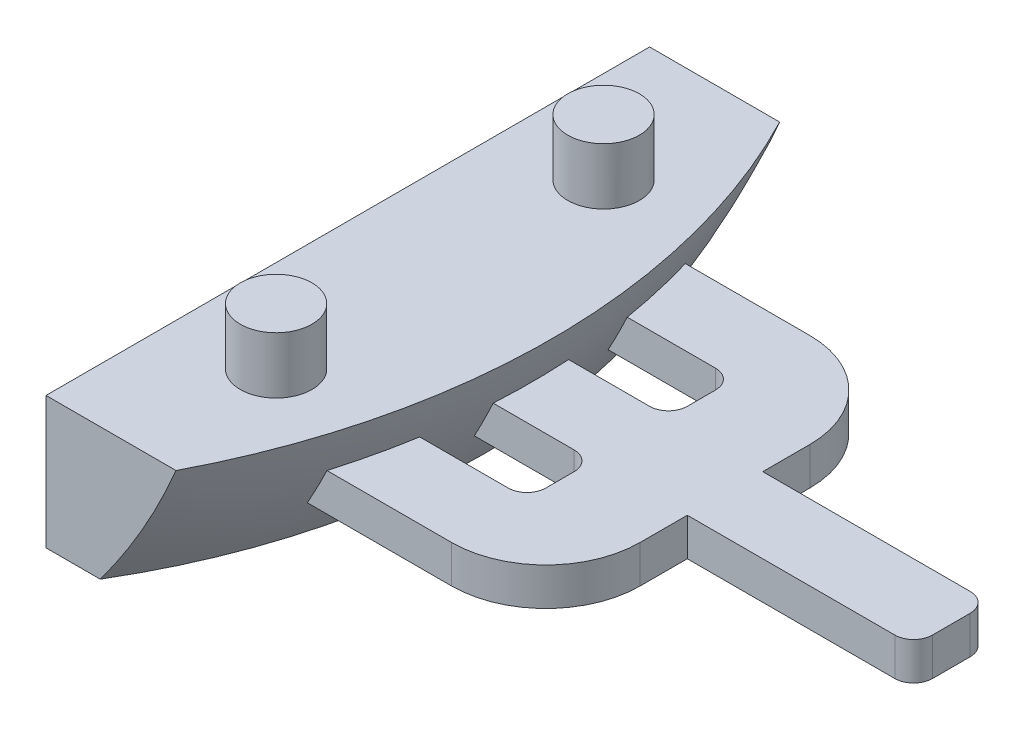
ISO-10303-21;
HEADER;
FILE_DESCRIPTION(('STEP AP214'),'2;1');
FILE_NAME('part.step','',(''),(''),'','','');
FILE_SCHEMA(('AUTOMOTIVE_DESIGN { 1 0 10303 214 1 1 1 1 }'));
ENDSEC;
DATA;
#1=APPLICATION_CONTEXT('core data for automotive mechanical design processes');
#2=APPLICATION_PROTOCOL_DEFINITION('international standard','automotive_design',2000,#1);
#3=PRODUCT_CONTEXT('',#1,'mechanical');
#4=PRODUCT('Part','Part','',(#3));
#5=PRODUCT_RELATED_PRODUCT_CATEGORY('part','',(#4));
#6=PRODUCT_DEFINITION_FORMATION('','',#4);
#7=PRODUCT_DEFINITION_CONTEXT('part definition',#1,'design');
#8=PRODUCT_DEFINITION('design','',#6,#7);
#9=PRODUCT_DEFINITION_SHAPE('','',#8);
#10=(LENGTH_UNIT() NAMED_UNIT(*) SI_UNIT(.MILLI.,.METRE.));
#11=(NAMED_UNIT(*) PLANE_ANGLE_UNIT() SI_UNIT($,.RADIAN.));
#12=(NAMED_UNIT(*) SI_UNIT($,.STERADIAN.) SOLID_ANGLE_UNIT());
#13=UNCERTAINTY_MEASURE_WITH_UNIT(LENGTH_MEASURE(1.E-05),#10,'distance_accuracy_value','');
#14=(GEOMETRIC_REPRESENTATION_CONTEXT(3) GLOBAL_UNCERTAINTY_ASSIGNED_CONTEXT((#13)) GLOBAL_UNIT_ASSIGNED_CONTEXT((#10,
#11,#12)) REPRESENTATION_CONTEXT('',''));
#15=CARTESIAN_POINT('',(0.,0.,0.));
#16=DIRECTION('',(0.,0.,1.));
#17=DIRECTION('',(1.,0.,0.));
#18=AXIS2_PLACEMENT_3D('',#15,#16,#17);
#19=CARTESIAN_POINT('',(43.83,0.,0.));
#20=DIRECTION('',(-1.,0.,0.));
#21=DIRECTION('',(0.,0.,1.));
#22=AXIS2_PLACEMENT_3D('',#19,#20,#21);
#23=PLANE('',#22);
#24=DIRECTION('',(0.,0.,-1.));
#25=VECTOR('',#24,1.);
#26=CARTESIAN_POINT('',(43.83,-17.5,9.5));
#27=LINE('',#26,#25);
#28=CARTESIAN_POINT('',(43.83,-17.5,-1.99999999999999));
#29=VERTEX_POINT('',#28);
#30=CARTESIAN_POINT('',(43.83,-17.5,-4.5));
#31=VERTEX_POINT('',#30);
#32=EDGE_CURVE('E240',#29,#31,#27,.T.);
#33=ORIENTED_EDGE('',*,*,#32,.T.);
#34=DIRECTION('',(0.,1.,0.));
#35=VECTOR('',#34,1.);
#36=CARTESIAN_POINT('',(43.83,-15.5,-4.49999999999999));
#37=LINE('',#36,#35);
#38=CARTESIAN_POINT('',(43.83,-15.5,-4.5));
#39=VERTEX_POINT('',#38);
#40=EDGE_CURVE('E248',#31,#39,#37,.T.);
#41=ORIENTED_EDGE('',*,*,#40,.T.);
#42=DIRECTION('',(0.,0.,1.));
#43=VECTOR('',#42,1.);
#44=CARTESIAN_POINT('',(43.83,-15.5,9.5));
#45=LINE('',#44,#43);
#46=CARTESIAN_POINT('',(43.83,-15.5,-1.99999999999999));
#47=VERTEX_POINT('',#46);
#48=EDGE_CURVE('E343',#39,#47,#45,.T.);
#49=ORIENTED_EDGE('',*,*,#48,.T.);
#50=DIRECTION('',(0.,1.,0.));
#51=VECTOR('',#50,1.);
#52=CARTESIAN_POINT('',(43.83,0.,-1.99999999999999));
#53=LINE('',#52,#51);
#54=EDGE_CURVE('E244',#29,#47,#53,.T.);
#55=ORIENTED_EDGE('',*,*,#54,.F.);
#56=EDGE_LOOP('',(#33,#41,#49,#55));
#57=FACE_BOUND('',#56,.T.);
#58=ADVANCED_FACE('F35',(#57),#23,.F.);
#59=CARTESIAN_POINT('',(0.,-13.,0.));
#60=DIRECTION('',(0.,-1.,0.));
#61=DIRECTION('',(0.,0.,-1.));
#62=AXIS2_PLACEMENT_3D('',#59,#60,#61);
#63=PLANE('',#62);
#64=CARTESIAN_POINT('',(28.71,-13.,8.68));
#65=DIRECTION('',(0.,-1.,0.));
#66=DIRECTION('',(0.,0.,-1.));
#67=AXIS2_PLACEMENT_3D('',#64,#65,#66);
#68=CIRCLE('',#67,1.9);
#69=CARTESIAN_POINT('',(28.71,-13.,6.78));
#70=VERTEX_POINT('',#69);
#71=EDGE_CURVE('E417',#70,#70,#68,.F.);
#72=ORIENTED_EDGE('',*,*,#71,.F.);
#73=EDGE_LOOP('',(#72));
#74=FACE_BOUND('',#73,.T.);
#75=CARTESIAN_POINT('',(28.71,-13.,-8.68));
#76=DIRECTION('',(0.,-1.,0.));
#77=DIRECTION('',(0.,0.,-1.));
#78=AXIS2_PLACEMENT_3D('',#75,#76,#77);
#79=CIRCLE('',#78,1.9);
#80=CARTESIAN_POINT('',(28.71,-13.,-10.58));
#81=VERTEX_POINT('',#80);
#82=EDGE_CURVE('E414',#81,#81,#79,.F.);
#83=ORIENTED_EDGE('',*,*,#82,.F.);
#84=EDGE_LOOP('',(#83));
#85=FACE_BOUND('',#84,.T.);
#86=CARTESIAN_POINT('',(0.,-13.,0.));
#87=DIRECTION('',(0.,-1.,0.));
#88=DIRECTION('',(0.,0.,-1.));
#89=AXIS2_PLACEMENT_3D('',#86,#87,#88);
#90=CIRCLE('',#89,34.6410161513775);
#91=CARTESIAN_POINT('',(30.7245829914744,-13.,-16.));
#92=VERTEX_POINT('',#91);
#93=CARTESIAN_POINT('',(30.7245829914744,-13.,16.));
#94=VERTEX_POINT('',#93);
#95=EDGE_CURVE('E412',#92,#94,#90,.T.);
#96=ORIENTED_EDGE('',*,*,#95,.F.);
#97=DIRECTION('',(1.,0.,0.));
#98=VECTOR('',#97,1.);
#99=CARTESIAN_POINT('',(0.,-13.,-16.));
#100=LINE('',#99,#98);
#101=CARTESIAN_POINT('',(23.83,-13.,-16.));
#102=VERTEX_POINT('',#101);
#103=EDGE_CURVE('E386',#102,#92,#100,.T.);
#104=ORIENTED_EDGE('',*,*,#103,.F.);
#105=DIRECTION('',(0.,0.,-1.));
#106=VECTOR('',#105,1.);
#107=CARTESIAN_POINT('',(23.83,-13.,0.));
#108=LINE('',#107,#106);
#109=CARTESIAN_POINT('',(23.83,-13.,16.));
#110=VERTEX_POINT('',#109);
#111=EDGE_CURVE('E383',#110,#102,#108,.T.);
#112=ORIENTED_EDGE('',*,*,#111,.F.);
#113=DIRECTION('',(1.,0.,0.));
#114=VECTOR('',#113,1.);
#115=CARTESIAN_POINT('',(0.,-13.,16.));
#116=LINE('',#115,#114);
#117=EDGE_CURVE('E390',#110,#94,#116,.T.);
#118=ORIENTED_EDGE('',*,*,#117,.T.);
#119=EDGE_LOOP('',(#96,#104,#112,#118));
#120=FACE_BOUND('',#119,.T.);
#121=ADVANCED_FACE('F535',(#74,#85,#120),#63,.F.);
#122=CARTESIAN_POINT('',(0.,-13.,16.));
#123=DIRECTION('',(0.,0.,-1.));
#124=DIRECTION('',(-1.,0.,0.));
#125=AXIS2_PLACEMENT_3D('',#122,#123,#124);
#126=PLANE('',#125);
#127=CARTESIAN_POINT('',(0.,0.,16.));
#128=DIRECTION('',(0.,0.,-1.));
#129=DIRECTION('',(-1.,0.,0.));
#130=AXIS2_PLACEMENT_3D('',#127,#128,#129);
#131=CIRCLE('',#130,33.3616546352246);
#132=CARTESIAN_POINT('',(26.7020598456374,-20.,16.));
#133=VERTEX_POINT('',#132);
#134=EDGE_CURVE('E407',#94,#133,#131,.T.);
#135=ORIENTED_EDGE('',*,*,#134,.F.);
#136=ORIENTED_EDGE('',*,*,#117,.F.);
#137=DIRECTION('',(0.,-1.,0.));
#138=VECTOR('',#137,1.);
#139=CARTESIAN_POINT('',(23.83,-13.,16.));
#140=LINE('',#139,#138);
#141=CARTESIAN_POINT('',(23.83,-20.,16.));
#142=VERTEX_POINT('',#141);
#143=EDGE_CURVE('E399',#110,#142,#140,.T.);
#144=ORIENTED_EDGE('',*,*,#143,.T.);
#145=DIRECTION('',(1.,0.,0.));
#146=VECTOR('',#145,1.);
#147=CARTESIAN_POINT('',(0.,-20.,16.));
#148=LINE('',#147,#146);
#149=EDGE_CURVE('E387',#142,#133,#148,.T.);
#150=ORIENTED_EDGE('',*,*,#149,.T.);
#151=EDGE_LOOP('',(#135,#136,#144,#150));
#152=FACE_BOUND('',#151,.T.);
#153=ADVANCED_FACE('F540',(#152),#126,.F.);
#154=CARTESIAN_POINT('',(0.,-13.,-16.));
#155=DIRECTION('',(0.,0.,-1.));
#156=DIRECTION('',(-1.,0.,0.));
#157=AXIS2_PLACEMENT_3D('',#154,#155,#156);
#158=PLANE('',#157);
#159=ORIENTED_EDGE('',*,*,#103,.T.);
#160=CARTESIAN_POINT('',(0.,0.,-16.));
#161=DIRECTION('',(0.,0.,-1.));
#162=DIRECTION('',(-1.,0.,0.));
#163=AXIS2_PLACEMENT_3D('',#160,#161,#162);
#164=CIRCLE('',#163,33.3616546352246);
#165=CARTESIAN_POINT('',(26.7020598456374,-20.,-16.));
#166=VERTEX_POINT('',#165);
#167=EDGE_CURVE('E402',#92,#166,#164,.T.);
#168=ORIENTED_EDGE('',*,*,#167,.T.);
#169=DIRECTION('',(1.,0.,0.));
#170=VECTOR('',#169,1.);
#171=CARTESIAN_POINT('',(0.,-20.,-16.));
#172=LINE('',#171,#170);
#173=CARTESIAN_POINT('',(23.83,-20.,-16.));
#174=VERTEX_POINT('',#173);
#175=EDGE_CURVE('E395',#174,#166,#172,.T.);
#176=ORIENTED_EDGE('',*,*,#175,.F.);
#177=DIRECTION('',(0.,-1.,0.));
#178=VECTOR('',#177,1.);
#179=CARTESIAN_POINT('',(23.83,-13.,-16.));
#180=LINE('',#179,#178);
#181=EDGE_CURVE('E393',#102,#174,#180,.T.);
#182=ORIENTED_EDGE('',*,*,#181,.F.);
#183=EDGE_LOOP('',(#159,#168,#176,#182));
#184=FACE_BOUND('',#183,.T.);
#185=ADVANCED_FACE('F591',(#184),#158,.T.);
#186=CARTESIAN_POINT('',(23.83,-13.,0.));
#187=DIRECTION('',(-1.,0.,0.));
#188=DIRECTION('',(0.,0.,1.));
#189=AXIS2_PLACEMENT_3D('',#186,#187,#188);
#190=PLANE('',#189);
#191=DIRECTION('',(0.,0.,-1.));
#192=VECTOR('',#191,1.);
#193=CARTESIAN_POINT('',(23.83,-20.,0.));
#194=LINE('',#193,#192);
#195=EDGE_CURVE('E382',#142,#174,#194,.T.);
#196=ORIENTED_EDGE('',*,*,#195,.F.);
#197=ORIENTED_EDGE('',*,*,#143,.F.);
#198=ORIENTED_EDGE('',*,*,#111,.T.);
#199=ORIENTED_EDGE('',*,*,#181,.T.);
#200=EDGE_LOOP('',(#196,#197,#198,#199));
#201=FACE_BOUND('',#200,.T.);
#202=ADVANCED_FACE('F595',(#201),#190,.T.);
#203=CARTESIAN_POINT('',(0.,0.,0.));
#204=DIRECTION('',(0.,1.,0.));
#205=DIRECTION('',(1.,0.,0.));
#206=AXIS2_PLACEMENT_3D('',#203,#204,#205);
#207=SPHERICAL_SURFACE('',#206,37.);
#208=CARTESIAN_POINT('',(0.,-17.5,0.));
#209=DIRECTION('',(0.,-1.,0.));
#210=DIRECTION('',(0.,0.,-1.));
#211=AXIS2_PLACEMENT_3D('',#208,#209,#210);
#212=CIRCLE('',#211,32.5998466254061);
#213=CARTESIAN_POINT('',(31.1849322590254,-17.5,-9.5));
#214=VERTEX_POINT('',#213);
#215=CARTESIAN_POINT('',(32.1325380261193,-17.5,-5.5));
#216=VERTEX_POINT('',#215);
#217=EDGE_CURVE('E251',#214,#216,#212,.T.);
#218=ORIENTED_EDGE('',*,*,#217,.T.);
#219=CARTESIAN_POINT('',(0.,0.,-5.5));
#220=DIRECTION('',(0.,0.,1.));
#221=DIRECTION('',(1.,0.,0.));
#222=AXIS2_PLACEMENT_3D('',#219,#220,#221);
#223=CIRCLE('',#222,36.5889327529514);
#224=CARTESIAN_POINT('',(33.1436268383531,-15.5,-5.5));
#225=VERTEX_POINT('',#224);
#226=EDGE_CURVE('E245',#216,#225,#223,.T.);
#227=ORIENTED_EDGE('',*,*,#226,.T.);
#228=CARTESIAN_POINT('',(0.,-15.5,0.));
#229=DIRECTION('',(0.,1.,0.));
#230=DIRECTION('',(0.,0.,1.));
#231=AXIS2_PLACEMENT_3D('',#228,#229,#230);
#232=CIRCLE('',#231,33.5968748546647);
#233=CARTESIAN_POINT('',(32.225766088644,-15.5,-9.5));
#234=VERTEX_POINT('',#233);
#235=EDGE_CURVE('E444',#225,#234,#232,.T.);
#236=ORIENTED_EDGE('',*,*,#235,.T.);
#237=CARTESIAN_POINT('',(0.,0.,-9.5));
#238=DIRECTION('',(0.,0.,-1.));
#239=DIRECTION('',(-1.,0.,0.));
#240=AXIS2_PLACEMENT_3D('',#237,#238,#239);
#241=CIRCLE('',#240,35.7596140918774);
#242=EDGE_CURVE('E447',#234,#214,#241,.T.);
#243=ORIENTED_EDGE('',*,*,#242,.T.);
#244=EDGE_LOOP('',(#218,#227,#236,#243));
#245=FACE_BOUND('',#244,.T.);
#246=CARTESIAN_POINT('',(0.,-17.5,0.));
#247=DIRECTION('',(0.,-1.,0.));
#248=DIRECTION('',(0.,0.,-1.));
#249=AXIS2_PLACEMENT_3D('',#246,#247,#248);
#250=CIRCLE('',#249,32.5998466254061);
#251=CARTESIAN_POINT('',(32.1325380261192,-17.5,5.5));
#252=VERTEX_POINT('',#251);
#253=CARTESIAN_POINT('',(31.1849322590253,-17.5,9.5));
#254=VERTEX_POINT('',#253);
#255=EDGE_CURVE('E438',#252,#254,#250,.T.);
#256=ORIENTED_EDGE('',*,*,#255,.T.);
#257=CARTESIAN_POINT('',(0.,0.,9.49999999999999));
#258=DIRECTION('',(0.,0.,1.));
#259=DIRECTION('',(1.,0.,0.));
#260=AXIS2_PLACEMENT_3D('',#257,#258,#259);
#261=CIRCLE('',#260,35.7596140918774);
#262=CARTESIAN_POINT('',(32.225766088644,-15.5,9.5));
#263=VERTEX_POINT('',#262);
#264=EDGE_CURVE('E441',#254,#263,#261,.T.);
#265=ORIENTED_EDGE('',*,*,#264,.T.);
#266=CARTESIAN_POINT('',(0.,-15.5,0.));
#267=DIRECTION('',(0.,1.,0.));
#268=DIRECTION('',(0.,0.,1.));
#269=AXIS2_PLACEMENT_3D('',#266,#267,#268);
#270=CIRCLE('',#269,33.5968748546647);
#271=CARTESIAN_POINT('',(33.1436268383531,-15.5,5.5));
#272=VERTEX_POINT('',#271);
#273=EDGE_CURVE('E432',#263,#272,#270,.T.);
#274=ORIENTED_EDGE('',*,*,#273,.T.);
#275=CARTESIAN_POINT('',(0.,0.,5.49999999999999));
#276=DIRECTION('',(0.,0.,-1.));
#277=DIRECTION('',(-1.,0.,0.));
#278=AXIS2_PLACEMENT_3D('',#275,#276,#277);
#279=CIRCLE('',#278,36.5889327529514);
#280=EDGE_CURVE('E435',#272,#252,#279,.T.);
#281=ORIENTED_EDGE('',*,*,#280,.T.);
#282=EDGE_LOOP('',(#256,#265,#274,#281));
#283=FACE_BOUND('',#282,.T.);
#284=CARTESIAN_POINT('',(0.,-17.5,0.));
#285=DIRECTION('',(0.,-1.,0.));
#286=DIRECTION('',(0.,0.,-1.));
#287=AXIS2_PLACEMENT_3D('',#284,#285,#286);
#288=CIRCLE('',#287,32.5998466254061);
#289=CARTESIAN_POINT('',(32.5384388070479,-17.5,-2.));
#290=VERTEX_POINT('',#289);
#291=CARTESIAN_POINT('',(32.5384388070479,-17.5,2.));
#292=VERTEX_POINT('',#291);
#293=EDGE_CURVE('E426',#290,#292,#288,.T.);
#294=ORIENTED_EDGE('',*,*,#293,.T.);
#295=CARTESIAN_POINT('',(0.,0.,2.));
#296=DIRECTION('',(0.,0.,1.));
#297=DIRECTION('',(1.,0.,0.));
#298=AXIS2_PLACEMENT_3D('',#295,#296,#297);
#299=CIRCLE('',#298,36.9459064038223);
#300=CARTESIAN_POINT('',(33.537292675468,-15.5,2.));
#301=VERTEX_POINT('',#300);
#302=EDGE_CURVE('E429',#292,#301,#299,.T.);
#303=ORIENTED_EDGE('',*,*,#302,.T.);
#304=CARTESIAN_POINT('',(0.,-15.5,0.));
#305=DIRECTION('',(0.,1.,0.));
#306=DIRECTION('',(0.,0.,1.));
#307=AXIS2_PLACEMENT_3D('',#304,#305,#306);
#308=CIRCLE('',#307,33.5968748546647);
#309=CARTESIAN_POINT('',(33.537292675468,-15.5,-2.));
#310=VERTEX_POINT('',#309);
#311=EDGE_CURVE('E420',#301,#310,#308,.T.);
#312=ORIENTED_EDGE('',*,*,#311,.T.);
#313=CARTESIAN_POINT('',(0.,0.,-2.));
#314=DIRECTION('',(0.,0.,-1.));
#315=DIRECTION('',(-1.,0.,0.));
#316=AXIS2_PLACEMENT_3D('',#313,#314,#315);
#317=CIRCLE('',#316,36.9459064038223);
#318=EDGE_CURVE('E423',#310,#290,#317,.T.);
#319=ORIENTED_EDGE('',*,*,#318,.T.);
#320=EDGE_LOOP('',(#294,#303,#312,#319));
#321=FACE_BOUND('',#320,.T.);
#322=ORIENTED_EDGE('',*,*,#95,.T.);
#323=ORIENTED_EDGE('',*,*,#134,.T.);
#324=CARTESIAN_POINT('',(0.,-20.,0.));
#325=DIRECTION('',(0.,1.,0.));
#326=DIRECTION('',(0.,0.,1.));
#327=AXIS2_PLACEMENT_3D('',#324,#325,#326);
#328=CIRCLE('',#327,31.1287648325468);
#329=EDGE_CURVE('E409',#133,#166,#328,.T.);
#330=ORIENTED_EDGE('',*,*,#329,.T.);
#331=ORIENTED_EDGE('',*,*,#167,.F.);
#332=EDGE_LOOP('',(#322,#323,#330,#331));
#333=FACE_BOUND('',#332,.T.);
#334=ADVANCED_FACE('F452',(#245,#283,#321,#333),#207,.T.);
#335=CARTESIAN_POINT('',(-37.7185254901961,-20.,-80.));
#336=DIRECTION('',(0.,1.,0.));
#337=DIRECTION('',(0.,0.,1.));
#338=AXIS2_PLACEMENT_3D('',#335,#336,#337);
#339=PLANE('',#338);
#340=ORIENTED_EDGE('',*,*,#329,.F.);
#341=ORIENTED_EDGE('',*,*,#149,.F.);
#342=ORIENTED_EDGE('',*,*,#195,.T.);
#343=ORIENTED_EDGE('',*,*,#175,.T.);
#344=EDGE_LOOP('',(#340,#341,#342,#343));
#345=FACE_BOUND('',#344,.T.);
#346=ADVANCED_FACE('F586',(#345),#339,.F.);
#347=CARTESIAN_POINT('',(28.71,-10.,-8.68));
#348=DIRECTION('',(0.,-1.,0.));
#349=DIRECTION('',(0.,0.,-1.));
#350=AXIS2_PLACEMENT_3D('',#347,#348,#349);
#351=CYLINDRICAL_SURFACE('',#350,1.9);
#352=CARTESIAN_POINT('',(28.71,-10.,-8.68));
#353=DIRECTION('',(0.,1.,0.));
#354=DIRECTION('',(0.,0.,1.));
#355=AXIS2_PLACEMENT_3D('',#352,#353,#354);
#356=CIRCLE('',#355,1.9);
#357=CARTESIAN_POINT('',(28.71,-10.,-6.78));
#358=VERTEX_POINT('',#357);
#359=EDGE_CURVE('E379',#358,#358,#356,.T.);
#360=ORIENTED_EDGE('',*,*,#359,.F.);
#361=EDGE_LOOP('',(#360));
#362=FACE_BOUND('',#361,.T.);
#363=ORIENTED_EDGE('',*,*,#82,.T.);
#364=EDGE_LOOP('',(#363));
#365=FACE_BOUND('',#364,.T.);
#366=ADVANCED_FACE('F583',(#362,#365),#351,.T.);
#367=CARTESIAN_POINT('',(28.71,-10.,-8.68));
#368=DIRECTION('',(0.,1.,0.));
#369=DIRECTION('',(0.,0.,1.));
#370=AXIS2_PLACEMENT_3D('',#367,#368,#369);
#371=PLANE('',#370);
#372=ORIENTED_EDGE('',*,*,#359,.T.);
#373=EDGE_LOOP('',(#372));
#374=FACE_BOUND('',#373,.T.);
#375=ADVANCED_FACE('F579',(#374),#371,.T.);
#376=CARTESIAN_POINT('',(28.71,-10.,8.68));
#377=DIRECTION('',(0.,-1.,0.));
#378=DIRECTION('',(0.,0.,-1.));
#379=AXIS2_PLACEMENT_3D('',#376,#377,#378);
#380=CYLINDRICAL_SURFACE('',#379,1.9);
#381=CARTESIAN_POINT('',(28.71,-10.,8.68));
#382=DIRECTION('',(0.,1.,0.));
#383=DIRECTION('',(0.,0.,-1.));
#384=AXIS2_PLACEMENT_3D('',#381,#382,#383);
#385=CIRCLE('',#384,1.9);
#386=CARTESIAN_POINT('',(28.71,-10.,6.78));
#387=VERTEX_POINT('',#386);
#388=EDGE_CURVE('E371',#387,#387,#385,.T.);
#389=ORIENTED_EDGE('',*,*,#388,.F.);
#390=EDGE_LOOP('',(#389));
#391=FACE_BOUND('',#390,.T.);
#392=ORIENTED_EDGE('',*,*,#71,.T.);
#393=EDGE_LOOP('',(#392));
#394=FACE_BOUND('',#393,.T.);
#395=ADVANCED_FACE('F575',(#391,#394),#380,.T.);
#396=CARTESIAN_POINT('',(28.71,-10.,8.68));
#397=DIRECTION('',(0.,-1.,0.));
#398=DIRECTION('',(0.,0.,-1.));
#399=AXIS2_PLACEMENT_3D('',#396,#397,#398);
#400=PLANE('',#399);
#401=ORIENTED_EDGE('',*,*,#388,.T.);
#402=EDGE_LOOP('',(#401));
#403=FACE_BOUND('',#402,.T.);
#404=ADVANCED_FACE('F572',(#403),#400,.F.);
#405=CARTESIAN_POINT('',(38.83,-17.5,2.));
#406=DIRECTION('',(0.,0.,1.));
#407=DIRECTION('',(1.,0.,0.));
#408=AXIS2_PLACEMENT_3D('',#405,#406,#407);
#409=PLANE('',#408);
#410=DIRECTION('',(-1.,0.,0.));
#411=VECTOR('',#410,1.);
#412=CARTESIAN_POINT('',(38.83,-17.5,2.));
#413=LINE('',#412,#411);
#414=CARTESIAN_POINT('',(37.83,-17.5,2.));
#415=VERTEX_POINT('',#414);
#416=EDGE_CURVE('E369',#415,#292,#413,.T.);
#417=ORIENTED_EDGE('',*,*,#416,.F.);
#418=DIRECTION('',(0.,1.,0.));
#419=VECTOR('',#418,1.);
#420=CARTESIAN_POINT('',(37.83,-15.5,2.));
#421=LINE('',#420,#419);
#422=CARTESIAN_POINT('',(37.83,-15.5,2.));
#423=VERTEX_POINT('',#422);
#424=EDGE_CURVE('E280',#415,#423,#421,.T.);
#425=ORIENTED_EDGE('',*,*,#424,.T.);
#426=DIRECTION('',(-1.,0.,0.));
#427=VECTOR('',#426,1.);
#428=CARTESIAN_POINT('',(38.83,-15.5,2.));
#429=LINE('',#428,#427);
#430=EDGE_CURVE('E363',#423,#301,#429,.T.);
#431=ORIENTED_EDGE('',*,*,#430,.T.);
#432=ORIENTED_EDGE('',*,*,#302,.F.);
#433=EDGE_LOOP('',(#417,#425,#431,#432));
#434=FACE_BOUND('',#433,.T.);
#435=ADVANCED_FACE('F499',(#434),#409,.T.);
#436=CARTESIAN_POINT('',(38.83,-17.5,-2.));
#437=DIRECTION('',(0.,-1.,0.));
#438=DIRECTION('',(0.,0.,-1.));
#439=AXIS2_PLACEMENT_3D('',#436,#437,#438);
#440=PLANE('',#439);
#441=DIRECTION('',(-1.,0.,0.));
#442=VECTOR('',#441,1.);
#443=CARTESIAN_POINT('',(55.83,-17.5,-1.99999999999999));
#444=LINE('',#443,#442);
#445=CARTESIAN_POINT('',(54.83,-17.5,-1.99999999999999));
#446=VERTEX_POINT('',#445);
#447=EDGE_CURVE('E320',#446,#29,#444,.T.);
#448=ORIENTED_EDGE('',*,*,#447,.F.);
#449=CARTESIAN_POINT('',(54.83,-17.5,-0.999999999999994));
#450=DIRECTION('',(0.,-1.,0.));
#451=DIRECTION('',(0.,0.,-1.));
#452=AXIS2_PLACEMENT_3D('',#449,#450,#451);
#453=CIRCLE('',#452,1.);
#454=CARTESIAN_POINT('',(55.83,-17.5,-0.999999999999994));
#455=VERTEX_POINT('',#454);
#456=EDGE_CURVE('E43',#446,#455,#453,.T.);
#457=ORIENTED_EDGE('',*,*,#456,.T.);
#458=DIRECTION('',(0.,0.,1.));
#459=VECTOR('',#458,1.);
#460=CARTESIAN_POINT('',(55.83,-17.5,0.));
#461=LINE('',#460,#459);
#462=CARTESIAN_POINT('',(55.83,-17.5,1.00000000000001));
#463=VERTEX_POINT('',#462);
#464=EDGE_CURVE('E318',#455,#463,#461,.T.);
#465=ORIENTED_EDGE('',*,*,#464,.T.);
#466=CARTESIAN_POINT('',(54.83,-17.5,1.00000000000001));
#467=DIRECTION('',(0.,-1.,0.));
#468=DIRECTION('',(0.,0.,-1.));
#469=AXIS2_PLACEMENT_3D('',#466,#467,#468);
#470=CIRCLE('',#469,1.);
#471=CARTESIAN_POINT('',(54.83,-17.5,2.00000000000001));
#472=VERTEX_POINT('',#471);
#473=EDGE_CURVE('E50',#463,#472,#470,.T.);
#474=ORIENTED_EDGE('',*,*,#473,.T.);
#475=DIRECTION('',(-1.,0.,0.));
#476=VECTOR('',#475,1.);
#477=CARTESIAN_POINT('',(55.83,-17.5,2.00000000000001));
#478=LINE('',#477,#476);
#479=CARTESIAN_POINT('',(43.83,-17.5,2.00000000000001));
#480=VERTEX_POINT('',#479);
#481=EDGE_CURVE('E220',#472,#480,#478,.T.);
#482=ORIENTED_EDGE('',*,*,#481,.T.);
#483=CARTESIAN_POINT('',(43.83,-17.5,4.5));
#484=VERTEX_POINT('',#483);
#485=EDGE_CURVE('E223',#484,#480,#27,.T.);
#486=ORIENTED_EDGE('',*,*,#485,.F.);
#487=CARTESIAN_POINT('',(38.83,-17.5,4.5));
#488=DIRECTION('',(0.,-1.,0.));
#489=DIRECTION('',(0.,0.,-1.));
#490=AXIS2_PLACEMENT_3D('',#487,#488,#489);
#491=CIRCLE('',#490,5.);
#492=CARTESIAN_POINT('',(38.83,-17.5,9.5));
#493=VERTEX_POINT('',#492);
#494=EDGE_CURVE('E263',#484,#493,#491,.T.);
#495=ORIENTED_EDGE('',*,*,#494,.T.);
#496=DIRECTION('',(-1.,0.,0.));
#497=VECTOR('',#496,1.);
#498=CARTESIAN_POINT('',(38.83,-17.5,9.5));
#499=LINE('',#498,#497);
#500=EDGE_CURVE('E361',#493,#254,#499,.T.);
#501=ORIENTED_EDGE('',*,*,#500,.T.);
#502=ORIENTED_EDGE('',*,*,#255,.F.);
#503=DIRECTION('',(-1.,0.,0.));
#504=VECTOR('',#503,1.);
#505=CARTESIAN_POINT('',(38.83,-17.5,5.5));
#506=LINE('',#505,#504);
#507=CARTESIAN_POINT('',(37.83,-17.5,5.5));
#508=VERTEX_POINT('',#507);
#509=EDGE_CURVE('E364',#508,#252,#506,.T.);
#510=ORIENTED_EDGE('',*,*,#509,.F.);
#511=CARTESIAN_POINT('',(37.83,-17.5,4.5));
#512=DIRECTION('',(0.,-1.,0.));
#513=DIRECTION('',(0.,0.,-1.));
#514=AXIS2_PLACEMENT_3D('',#511,#512,#513);
#515=CIRCLE('',#514,1.);
#516=CARTESIAN_POINT('',(38.83,-17.5,4.5));
#517=VERTEX_POINT('',#516);
#518=EDGE_CURVE('E302',#508,#517,#515,.F.);
#519=ORIENTED_EDGE('',*,*,#518,.T.);
#520=DIRECTION('',(0.,0.,-1.));
#521=VECTOR('',#520,1.);
#522=CARTESIAN_POINT('',(38.83,-17.5,9.5));
#523=LINE('',#522,#521);
#524=CARTESIAN_POINT('',(38.83,-17.5,3.));
#525=VERTEX_POINT('',#524);
#526=EDGE_CURVE('E346',#517,#525,#523,.T.);
#527=ORIENTED_EDGE('',*,*,#526,.T.);
#528=CARTESIAN_POINT('',(37.83,-17.5,3.));
#529=DIRECTION('',(0.,-1.,0.));
#530=DIRECTION('',(0.,0.,-1.));
#531=AXIS2_PLACEMENT_3D('',#528,#529,#530);
#532=CIRCLE('',#531,1.);
#533=EDGE_CURVE('E300',#525,#415,#532,.F.);
#534=ORIENTED_EDGE('',*,*,#533,.T.);
#535=ORIENTED_EDGE('',*,*,#416,.T.);
#536=ORIENTED_EDGE('',*,*,#293,.F.);
#537=DIRECTION('',(-1.,0.,0.));
#538=VECTOR('',#537,1.);
#539=CARTESIAN_POINT('',(38.83,-17.5,-2.));
#540=LINE('',#539,#538);
#541=CARTESIAN_POINT('',(37.83,-17.5,-2.));
#542=VERTEX_POINT('',#541);
#543=EDGE_CURVE('E372',#542,#290,#540,.T.);
#544=ORIENTED_EDGE('',*,*,#543,.F.);
#545=CARTESIAN_POINT('',(37.83,-17.5,-3.));
#546=DIRECTION('',(0.,-1.,0.));
#547=DIRECTION('',(0.,0.,-1.));
#548=AXIS2_PLACEMENT_3D('',#545,#546,#547);
#549=CIRCLE('',#548,1.);
#550=CARTESIAN_POINT('',(38.83,-17.5,-3.));
#551=VERTEX_POINT('',#550);
#552=EDGE_CURVE('E294',#542,#551,#549,.F.);
#553=ORIENTED_EDGE('',*,*,#552,.T.);
#554=CARTESIAN_POINT('',(38.83,-17.5,-4.5));
#555=VERTEX_POINT('',#554);
#556=EDGE_CURVE('E338',#551,#555,#523,.T.);
#557=ORIENTED_EDGE('',*,*,#556,.T.);
#558=CARTESIAN_POINT('',(37.83,-17.5,-4.5));
#559=DIRECTION('',(0.,-1.,0.));
#560=DIRECTION('',(0.,0.,-1.));
#561=AXIS2_PLACEMENT_3D('',#558,#559,#560);
#562=CIRCLE('',#561,1.);
#563=CARTESIAN_POINT('',(37.83,-17.5,-5.5));
#564=VERTEX_POINT('',#563);
#565=EDGE_CURVE('E292',#555,#564,#562,.F.);
#566=ORIENTED_EDGE('',*,*,#565,.T.);
#567=DIRECTION('',(-1.,0.,0.));
#568=VECTOR('',#567,1.);
#569=CARTESIAN_POINT('',(38.83,-17.5,-5.5));
#570=LINE('',#569,#568);
#571=EDGE_CURVE('E353',#564,#216,#570,.T.);
#572=ORIENTED_EDGE('',*,*,#571,.T.);
#573=ORIENTED_EDGE('',*,*,#217,.F.);
#574=DIRECTION('',(-1.,0.,0.));
#575=VECTOR('',#574,1.);
#576=CARTESIAN_POINT('',(38.83,-17.5,-9.49999999999999));
#577=LINE('',#576,#575);
#578=CARTESIAN_POINT('',(38.83,-17.5,-9.49999999999999));
#579=VERTEX_POINT('',#578);
#580=EDGE_CURVE('E356',#579,#214,#577,.T.);
#581=ORIENTED_EDGE('',*,*,#580,.F.);
#582=CARTESIAN_POINT('',(38.83,-17.5,-4.49999999999999));
#583=DIRECTION('',(0.,-1.,0.));
#584=DIRECTION('',(0.,0.,-1.));
#585=AXIS2_PLACEMENT_3D('',#582,#583,#584);
#586=CIRCLE('',#585,5.);
#587=EDGE_CURVE('E265',#579,#31,#586,.T.);
#588=ORIENTED_EDGE('',*,*,#587,.T.);
#589=ORIENTED_EDGE('',*,*,#32,.F.);
#590=EDGE_LOOP('',(#448,#457,#465,#474,#482,#486,#495,#501,#502,#510,#519,#527,#534,#535,#536,
#544,#553,#557,#566,#572,#573,#581,#588,#589));
#591=FACE_BOUND('',#590,.T.);
#592=ADVANCED_FACE('F222',(#591),#440,.T.);
#593=CARTESIAN_POINT('',(38.83,-17.5,-2.));
#594=DIRECTION('',(0.,0.,-1.));
#595=DIRECTION('',(-1.,0.,0.));
#596=AXIS2_PLACEMENT_3D('',#593,#594,#595);
#597=PLANE('',#596);
#598=DIRECTION('',(-1.,0.,0.));
#599=VECTOR('',#598,1.);
#600=CARTESIAN_POINT('',(38.83,-15.5,-2.));
#601=LINE('',#600,#599);
#602=CARTESIAN_POINT('',(37.83,-15.5,-2.));
#603=VERTEX_POINT('',#602);
#604=EDGE_CURVE('E374',#603,#310,#601,.T.);
#605=ORIENTED_EDGE('',*,*,#604,.F.);
#606=DIRECTION('',(0.,-1.,0.));
#607=VECTOR('',#606,1.);
#608=CARTESIAN_POINT('',(37.83,-17.5,-2.));
#609=LINE('',#608,#607);
#610=EDGE_CURVE('E277',#603,#542,#609,.T.);
#611=ORIENTED_EDGE('',*,*,#610,.T.);
#612=ORIENTED_EDGE('',*,*,#543,.T.);
#613=ORIENTED_EDGE('',*,*,#318,.F.);
#614=EDGE_LOOP('',(#605,#611,#612,#613));
#615=FACE_BOUND('',#614,.T.);
#616=ADVANCED_FACE('F487',(#615),#597,.T.);
#617=CARTESIAN_POINT('',(38.83,-15.5,-2.));
#618=DIRECTION('',(0.,1.,0.));
#619=DIRECTION('',(0.,0.,1.));
#620=AXIS2_PLACEMENT_3D('',#617,#618,#619);
#621=PLANE('',#620);
#622=DIRECTION('',(0.,0.,1.));
#623=VECTOR('',#622,1.);
#624=CARTESIAN_POINT('',(55.83,-15.5,0.));
#625=LINE('',#624,#623);
#626=CARTESIAN_POINT('',(55.83,-15.5,-0.999999999999994));
#627=VERTEX_POINT('',#626);
#628=CARTESIAN_POINT('',(55.83,-15.5,1.00000000000001));
#629=VERTEX_POINT('',#628);
#630=EDGE_CURVE('E228',#627,#629,#625,.T.);
#631=ORIENTED_EDGE('',*,*,#630,.F.);
#632=CARTESIAN_POINT('',(54.83,-15.5,-0.999999999999994));
#633=DIRECTION('',(0.,1.,0.));
#634=DIRECTION('',(0.,0.,1.));
#635=AXIS2_PLACEMENT_3D('',#632,#633,#634);
#636=CIRCLE('',#635,1.);
#637=CARTESIAN_POINT('',(54.83,-15.5,-1.99999999999999));
#638=VERTEX_POINT('',#637);
#639=EDGE_CURVE('E313',#627,#638,#636,.T.);
#640=ORIENTED_EDGE('',*,*,#639,.T.);
#641=DIRECTION('',(-1.,0.,0.));
#642=VECTOR('',#641,1.);
#643=CARTESIAN_POINT('',(55.83,-15.5,-1.99999999999999));
#644=LINE('',#643,#642);
#645=EDGE_CURVE('E333',#638,#47,#644,.T.);
#646=ORIENTED_EDGE('',*,*,#645,.T.);
#647=ORIENTED_EDGE('',*,*,#48,.F.);
#648=CARTESIAN_POINT('',(38.83,-15.5,-4.49999999999999));
#649=DIRECTION('',(0.,1.,0.));
#650=DIRECTION('',(0.,0.,1.));
#651=AXIS2_PLACEMENT_3D('',#648,#649,#650);
#652=CIRCLE('',#651,5.);
#653=CARTESIAN_POINT('',(38.83,-15.5,-9.49999999999999));
#654=VERTEX_POINT('',#653);
#655=EDGE_CURVE('E259',#39,#654,#652,.T.);
#656=ORIENTED_EDGE('',*,*,#655,.T.);
#657=DIRECTION('',(-1.,0.,0.));
#658=VECTOR('',#657,1.);
#659=CARTESIAN_POINT('',(38.83,-15.5,-9.49999999999999));
#660=LINE('',#659,#658);
#661=EDGE_CURVE('E358',#654,#234,#660,.T.);
#662=ORIENTED_EDGE('',*,*,#661,.T.);
#663=ORIENTED_EDGE('',*,*,#235,.F.);
#664=DIRECTION('',(-1.,0.,0.));
#665=VECTOR('',#664,1.);
#666=CARTESIAN_POINT('',(38.83,-15.5,-5.5));
#667=LINE('',#666,#665);
#668=CARTESIAN_POINT('',(37.83,-15.5,-5.5));
#669=VERTEX_POINT('',#668);
#670=EDGE_CURVE('E345',#669,#225,#667,.T.);
#671=ORIENTED_EDGE('',*,*,#670,.F.);
#672=CARTESIAN_POINT('',(37.83,-15.5,-4.5));
#673=DIRECTION('',(0.,1.,0.));
#674=DIRECTION('',(0.,0.,1.));
#675=AXIS2_PLACEMENT_3D('',#672,#673,#674);
#676=CIRCLE('',#675,1.);
#677=CARTESIAN_POINT('',(38.83,-15.5,-4.5));
#678=VERTEX_POINT('',#677);
#679=EDGE_CURVE('E290',#669,#678,#676,.F.);
#680=ORIENTED_EDGE('',*,*,#679,.T.);
#681=DIRECTION('',(0.,0.,1.));
#682=VECTOR('',#681,1.);
#683=CARTESIAN_POINT('',(38.83,-15.5,9.5));
#684=LINE('',#683,#682);
#685=CARTESIAN_POINT('',(38.83,-15.5,-3.));
#686=VERTEX_POINT('',#685);
#687=EDGE_CURVE('E352',#678,#686,#684,.T.);
#688=ORIENTED_EDGE('',*,*,#687,.T.);
#689=CARTESIAN_POINT('',(37.83,-15.5,-3.));
#690=DIRECTION('',(0.,1.,0.));
#691=DIRECTION('',(0.,0.,1.));
#692=AXIS2_PLACEMENT_3D('',#689,#690,#691);
#693=CIRCLE('',#692,1.);
#694=EDGE_CURVE('E296',#686,#603,#693,.F.);
#695=ORIENTED_EDGE('',*,*,#694,.T.);
#696=ORIENTED_EDGE('',*,*,#604,.T.);
#697=ORIENTED_EDGE('',*,*,#311,.F.);
#698=ORIENTED_EDGE('',*,*,#430,.F.);
#699=CARTESIAN_POINT('',(37.83,-15.5,3.));
#700=DIRECTION('',(0.,1.,0.));
#701=DIRECTION('',(0.,0.,1.));
#702=AXIS2_PLACEMENT_3D('',#699,#700,#701);
#703=CIRCLE('',#702,1.);
#704=CARTESIAN_POINT('',(38.83,-15.5,3.));
#705=VERTEX_POINT('',#704);
#706=EDGE_CURVE('E298',#423,#705,#703,.F.);
#707=ORIENTED_EDGE('',*,*,#706,.T.);
#708=CARTESIAN_POINT('',(38.83,-15.5,4.5));
#709=VERTEX_POINT('',#708);
#710=EDGE_CURVE('E349',#705,#709,#684,.T.);
#711=ORIENTED_EDGE('',*,*,#710,.T.);
#712=CARTESIAN_POINT('',(37.83,-15.5,4.5));
#713=DIRECTION('',(0.,1.,0.));
#714=DIRECTION('',(0.,0.,1.));
#715=AXIS2_PLACEMENT_3D('',#712,#713,#714);
#716=CIRCLE('',#715,1.);
#717=CARTESIAN_POINT('',(37.83,-15.5,5.5));
#718=VERTEX_POINT('',#717);
#719=EDGE_CURVE('E304',#709,#718,#716,.F.);
#720=ORIENTED_EDGE('',*,*,#719,.T.);
#721=DIRECTION('',(-1.,0.,0.));
#722=VECTOR('',#721,1.);
#723=CARTESIAN_POINT('',(38.83,-15.5,5.5));
#724=LINE('',#723,#722);
#725=EDGE_CURVE('E366',#718,#272,#724,.T.);
#726=ORIENTED_EDGE('',*,*,#725,.T.);
#727=ORIENTED_EDGE('',*,*,#273,.F.);
#728=DIRECTION('',(-1.,0.,0.));
#729=VECTOR('',#728,1.);
#730=CARTESIAN_POINT('',(38.83,-15.5,9.5));
#731=LINE('',#730,#729);
#732=CARTESIAN_POINT('',(38.83,-15.5,9.5));
#733=VERTEX_POINT('',#732);
#734=EDGE_CURVE('E355',#733,#263,#731,.T.);
#735=ORIENTED_EDGE('',*,*,#734,.F.);
#736=CARTESIAN_POINT('',(38.83,-15.5,4.5));
#737=DIRECTION('',(0.,1.,0.));
#738=DIRECTION('',(0.,0.,1.));
#739=AXIS2_PLACEMENT_3D('',#736,#737,#738);
#740=CIRCLE('',#739,5.);
#741=CARTESIAN_POINT('',(43.83,-15.5,4.5));
#742=VERTEX_POINT('',#741);
#743=EDGE_CURVE('E257',#733,#742,#740,.T.);
#744=ORIENTED_EDGE('',*,*,#743,.T.);
#745=CARTESIAN_POINT('',(43.83,-15.5,2.00000000000001));
#746=VERTEX_POINT('',#745);
#747=EDGE_CURVE('E239',#746,#742,#45,.T.);
#748=ORIENTED_EDGE('',*,*,#747,.F.);
#749=DIRECTION('',(-1.,0.,0.));
#750=VECTOR('',#749,1.);
#751=CARTESIAN_POINT('',(55.83,-15.5,2.00000000000001));
#752=LINE('',#751,#750);
#753=CARTESIAN_POINT('',(54.83,-15.5,2.00000000000001));
#754=VERTEX_POINT('',#753);
#755=EDGE_CURVE('E227',#754,#746,#752,.T.);
#756=ORIENTED_EDGE('',*,*,#755,.F.);
#757=CARTESIAN_POINT('',(54.83,-15.5,1.00000000000001));
#758=DIRECTION('',(0.,1.,0.));
#759=DIRECTION('',(0.,0.,1.));
#760=AXIS2_PLACEMENT_3D('',#757,#758,#759);
#761=CIRCLE('',#760,1.);
#762=EDGE_CURVE('E311',#754,#629,#761,.T.);
#763=ORIENTED_EDGE('',*,*,#762,.T.);
#764=EDGE_LOOP('',(#631,#640,#646,#647,#656,#662,#663,#671,#680,#688,#695,#696,#697,#698,#707,
#711,#720,#726,#727,#735,#744,#748,#756,#763));
#765=FACE_BOUND('',#764,.T.);
#766=ADVANCED_FACE('F331',(#765),#621,.T.);
#767=CARTESIAN_POINT('',(38.83,-17.5,9.5));
#768=DIRECTION('',(0.,0.,1.));
#769=DIRECTION('',(1.,0.,0.));
#770=AXIS2_PLACEMENT_3D('',#767,#768,#769);
#771=PLANE('',#770);
#772=ORIENTED_EDGE('',*,*,#500,.F.);
#773=DIRECTION('',(0.,-1.,0.));
#774=VECTOR('',#773,1.);
#775=CARTESIAN_POINT('',(38.83,-15.5,9.5));
#776=LINE('',#775,#774);
#777=EDGE_CURVE('E268',#493,#733,#776,.F.);
#778=ORIENTED_EDGE('',*,*,#777,.T.);
#779=ORIENTED_EDGE('',*,*,#734,.T.);
#780=ORIENTED_EDGE('',*,*,#264,.F.);
#781=EDGE_LOOP('',(#772,#778,#779,#780));
#782=FACE_BOUND('',#781,.T.);
#783=ADVANCED_FACE('F525',(#782),#771,.T.);
#784=CARTESIAN_POINT('',(38.83,-17.5,5.5));
#785=DIRECTION('',(0.,0.,-1.));
#786=DIRECTION('',(-1.,0.,0.));
#787=AXIS2_PLACEMENT_3D('',#784,#785,#786);
#788=PLANE('',#787);
#789=ORIENTED_EDGE('',*,*,#725,.F.);
#790=DIRECTION('',(0.,-1.,0.));
#791=VECTOR('',#790,1.);
#792=CARTESIAN_POINT('',(37.83,-17.5,5.5));
#793=LINE('',#792,#791);
#794=EDGE_CURVE('E287',#718,#508,#793,.T.);
#795=ORIENTED_EDGE('',*,*,#794,.T.);
#796=ORIENTED_EDGE('',*,*,#509,.T.);
#797=ORIENTED_EDGE('',*,*,#280,.F.);
#798=EDGE_LOOP('',(#789,#795,#796,#797));
#799=FACE_BOUND('',#798,.T.);
#800=ADVANCED_FACE('F517',(#799),#788,.T.);
#801=CARTESIAN_POINT('',(38.83,-17.5,-5.5));
#802=DIRECTION('',(0.,0.,1.));
#803=DIRECTION('',(1.,0.,0.));
#804=AXIS2_PLACEMENT_3D('',#801,#802,#803);
#805=PLANE('',#804);
#806=ORIENTED_EDGE('',*,*,#571,.F.);
#807=DIRECTION('',(0.,1.,0.));
#808=VECTOR('',#807,1.);
#809=CARTESIAN_POINT('',(37.83,-15.5,-5.5));
#810=LINE('',#809,#808);
#811=EDGE_CURVE('E270',#564,#669,#810,.T.);
#812=ORIENTED_EDGE('',*,*,#811,.T.);
#813=ORIENTED_EDGE('',*,*,#670,.T.);
#814=ORIENTED_EDGE('',*,*,#226,.F.);
#815=EDGE_LOOP('',(#806,#812,#813,#814));
#816=FACE_BOUND('',#815,.T.);
#817=ADVANCED_FACE('F463',(#816),#805,.T.);
#818=CARTESIAN_POINT('',(38.83,-17.5,-9.49999999999999));
#819=DIRECTION('',(0.,0.,-1.));
#820=DIRECTION('',(-1.,0.,0.));
#821=AXIS2_PLACEMENT_3D('',#818,#819,#820);
#822=PLANE('',#821);
#823=ORIENTED_EDGE('',*,*,#661,.F.);
#824=DIRECTION('',(0.,1.,0.));
#825=VECTOR('',#824,1.);
#826=CARTESIAN_POINT('',(38.83,-17.5,-9.49999999999999));
#827=LINE('',#826,#825);
#828=EDGE_CURVE('E261',#654,#579,#827,.F.);
#829=ORIENTED_EDGE('',*,*,#828,.T.);
#830=ORIENTED_EDGE('',*,*,#580,.T.);
#831=ORIENTED_EDGE('',*,*,#242,.F.);
#832=EDGE_LOOP('',(#823,#829,#830,#831));
#833=FACE_BOUND('',#832,.T.);
#834=ADVANCED_FACE('F469',(#833),#822,.T.);
#835=CARTESIAN_POINT('',(38.83,0.,0.));
#836=DIRECTION('',(-1.,0.,0.));
#837=DIRECTION('',(0.,0.,1.));
#838=AXIS2_PLACEMENT_3D('',#835,#836,#837);
#839=PLANE('',#838);
#840=ORIENTED_EDGE('',*,*,#710,.F.);
#841=DIRECTION('',(0.,1.,0.));
#842=VECTOR('',#841,1.);
#843=CARTESIAN_POINT('',(38.83,-17.5,3.));
#844=LINE('',#843,#842);
#845=EDGE_CURVE('E285',#705,#525,#844,.F.);
#846=ORIENTED_EDGE('',*,*,#845,.T.);
#847=ORIENTED_EDGE('',*,*,#526,.F.);
#848=DIRECTION('',(0.,-1.,0.));
#849=VECTOR('',#848,1.);
#850=CARTESIAN_POINT('',(38.83,-15.5,4.5));
#851=LINE('',#850,#849);
#852=EDGE_CURVE('E283',#517,#709,#851,.F.);
#853=ORIENTED_EDGE('',*,*,#852,.T.);
#854=EDGE_LOOP('',(#840,#846,#847,#853));
#855=FACE_BOUND('',#854,.T.);
#856=ADVANCED_FACE('F507',(#855),#839,.T.);
#857=ORIENTED_EDGE('',*,*,#687,.F.);
#858=DIRECTION('',(0.,1.,0.));
#859=VECTOR('',#858,1.);
#860=CARTESIAN_POINT('',(38.83,-17.5,-4.5));
#861=LINE('',#860,#859);
#862=EDGE_CURVE('E275',#678,#555,#861,.F.);
#863=ORIENTED_EDGE('',*,*,#862,.T.);
#864=ORIENTED_EDGE('',*,*,#556,.F.);
#865=DIRECTION('',(0.,-1.,0.));
#866=VECTOR('',#865,1.);
#867=CARTESIAN_POINT('',(38.83,-15.5,-3.));
#868=LINE('',#867,#866);
#869=EDGE_CURVE('E273',#551,#686,#868,.F.);
#870=ORIENTED_EDGE('',*,*,#869,.T.);
#871=EDGE_LOOP('',(#857,#863,#864,#870));
#872=FACE_BOUND('',#871,.T.);
#873=ADVANCED_FACE('F546',(#872),#839,.T.);
#874=ORIENTED_EDGE('',*,*,#747,.T.);
#875=DIRECTION('',(0.,-1.,0.));
#876=VECTOR('',#875,1.);
#877=CARTESIAN_POINT('',(43.83,-17.5,4.5));
#878=LINE('',#877,#876);
#879=EDGE_CURVE('E238',#742,#484,#878,.T.);
#880=ORIENTED_EDGE('',*,*,#879,.T.);
#881=ORIENTED_EDGE('',*,*,#485,.T.);
#882=DIRECTION('',(0.,1.,0.));
#883=VECTOR('',#882,1.);
#884=CARTESIAN_POINT('',(43.83,0.,2.00000000000001));
#885=LINE('',#884,#883);
#886=EDGE_CURVE('E235',#480,#746,#885,.T.);
#887=ORIENTED_EDGE('',*,*,#886,.T.);
#888=EDGE_LOOP('',(#874,#880,#881,#887));
#889=FACE_BOUND('',#888,.T.);
#890=ADVANCED_FACE('F234',(#889),#23,.F.);
#891=CARTESIAN_POINT('',(55.83,0.,-1.99999999999999));
#892=DIRECTION('',(0.,0.,1.));
#893=DIRECTION('',(1.,0.,0.));
#894=AXIS2_PLACEMENT_3D('',#891,#892,#893);
#895=PLANE('',#894);
#896=ORIENTED_EDGE('',*,*,#645,.F.);
#897=DIRECTION('',(0.,1.,0.));
#898=VECTOR('',#897,1.);
#899=CARTESIAN_POINT('',(54.83,0.,-1.99999999999999));
#900=LINE('',#899,#898);
#901=EDGE_CURVE('E58',#638,#446,#900,.F.);
#902=ORIENTED_EDGE('',*,*,#901,.T.);
#903=ORIENTED_EDGE('',*,*,#447,.T.);
#904=ORIENTED_EDGE('',*,*,#54,.T.);
#905=EDGE_LOOP('',(#896,#902,#903,#904));
#906=FACE_BOUND('',#905,.T.);
#907=ADVANCED_FACE('F335',(#906),#895,.F.);
#908=CARTESIAN_POINT('',(55.83,0.,2.00000000000001));
#909=DIRECTION('',(0.,0.,1.));
#910=DIRECTION('',(1.,0.,0.));
#911=AXIS2_PLACEMENT_3D('',#908,#909,#910);
#912=PLANE('',#911);
#913=ORIENTED_EDGE('',*,*,#481,.F.);
#914=DIRECTION('',(0.,1.,0.));
#915=VECTOR('',#914,1.);
#916=CARTESIAN_POINT('',(54.83,-15.5,2.00000000000001));
#917=LINE('',#916,#915);
#918=EDGE_CURVE('E11',#472,#754,#917,.T.);
#919=ORIENTED_EDGE('',*,*,#918,.T.);
#920=ORIENTED_EDGE('',*,*,#755,.T.);
#921=ORIENTED_EDGE('',*,*,#886,.F.);
#922=EDGE_LOOP('',(#913,#919,#920,#921));
#923=FACE_BOUND('',#922,.T.);
#924=ADVANCED_FACE('F242',(#923),#912,.T.);
#925=CARTESIAN_POINT('',(55.83,0.,0.));
#926=DIRECTION('',(-1.,0.,0.));
#927=DIRECTION('',(0.,0.,1.));
#928=AXIS2_PLACEMENT_3D('',#925,#926,#927);
#929=PLANE('',#928);
#930=ORIENTED_EDGE('',*,*,#464,.F.);
#931=DIRECTION('',(0.,1.,0.));
#932=VECTOR('',#931,1.);
#933=CARTESIAN_POINT('',(55.83,0.,-0.999999999999994));
#934=LINE('',#933,#932);
#935=EDGE_CURVE('E308',#455,#627,#934,.T.);
#936=ORIENTED_EDGE('',*,*,#935,.T.);
#937=ORIENTED_EDGE('',*,*,#630,.T.);
#938=DIRECTION('',(0.,1.,0.));
#939=VECTOR('',#938,1.);
#940=CARTESIAN_POINT('',(55.83,-17.5,1.00000000000001));
#941=LINE('',#940,#939);
#942=EDGE_CURVE('E306',#629,#463,#941,.F.);
#943=ORIENTED_EDGE('',*,*,#942,.T.);
#944=EDGE_LOOP('',(#930,#936,#937,#943));
#945=FACE_BOUND('',#944,.T.);
#946=ADVANCED_FACE('F324',(#945),#929,.F.);
#947=CARTESIAN_POINT('',(38.83,0.,-4.49999999999999));
#948=DIRECTION('',(0.,-1.,0.));
#949=DIRECTION('',(0.,0.,-1.));
#950=AXIS2_PLACEMENT_3D('',#947,#948,#949);
#951=CYLINDRICAL_SURFACE('',#950,5.);
#952=ORIENTED_EDGE('',*,*,#587,.F.);
#953=ORIENTED_EDGE('',*,*,#828,.F.);
#954=ORIENTED_EDGE('',*,*,#655,.F.);
#955=ORIENTED_EDGE('',*,*,#40,.F.);
#956=EDGE_LOOP('',(#952,#953,#954,#955));
#957=FACE_BOUND('',#956,.T.);
#958=ADVANCED_FACE('F471',(#957),#951,.T.);
#959=CARTESIAN_POINT('',(38.83,0.,4.5));
#960=DIRECTION('',(0.,1.,0.));
#961=DIRECTION('',(0.,0.,1.));
#962=AXIS2_PLACEMENT_3D('',#959,#960,#961);
#963=CYLINDRICAL_SURFACE('',#962,5.);
#964=ORIENTED_EDGE('',*,*,#743,.F.);
#965=ORIENTED_EDGE('',*,*,#777,.F.);
#966=ORIENTED_EDGE('',*,*,#494,.F.);
#967=ORIENTED_EDGE('',*,*,#879,.F.);
#968=EDGE_LOOP('',(#964,#965,#966,#967));
#969=FACE_BOUND('',#968,.T.);
#970=ADVANCED_FACE('F528',(#969),#963,.T.);
#971=CARTESIAN_POINT('',(37.83,-17.5,-4.5));
#972=DIRECTION('',(0.,-1.,0.));
#973=DIRECTION('',(0.,0.,-1.));
#974=AXIS2_PLACEMENT_3D('',#971,#972,#973);
#975=CYLINDRICAL_SURFACE('',#974,1.);
#976=ORIENTED_EDGE('',*,*,#565,.F.);
#977=ORIENTED_EDGE('',*,*,#862,.F.);
#978=ORIENTED_EDGE('',*,*,#679,.F.);
#979=ORIENTED_EDGE('',*,*,#811,.F.);
#980=EDGE_LOOP('',(#976,#977,#978,#979));
#981=FACE_BOUND('',#980,.T.);
#982=ADVANCED_FACE('F609',(#981),#975,.F.);
#983=CARTESIAN_POINT('',(37.83,-17.5,-3.));
#984=DIRECTION('',(0.,1.,0.));
#985=DIRECTION('',(0.,0.,1.));
#986=AXIS2_PLACEMENT_3D('',#983,#984,#985);
#987=CYLINDRICAL_SURFACE('',#986,1.);
#988=ORIENTED_EDGE('',*,*,#694,.F.);
#989=ORIENTED_EDGE('',*,*,#869,.F.);
#990=ORIENTED_EDGE('',*,*,#552,.F.);
#991=ORIENTED_EDGE('',*,*,#610,.F.);
#992=EDGE_LOOP('',(#988,#989,#990,#991));
#993=FACE_BOUND('',#992,.T.);
#994=ADVANCED_FACE('F484',(#993),#987,.F.);
#995=CARTESIAN_POINT('',(37.83,-17.5,3.));
#996=DIRECTION('',(0.,-1.,0.));
#997=DIRECTION('',(0.,0.,-1.));
#998=AXIS2_PLACEMENT_3D('',#995,#996,#997);
#999=CYLINDRICAL_SURFACE('',#998,1.);
#1000=ORIENTED_EDGE('',*,*,#533,.F.);
#1001=ORIENTED_EDGE('',*,*,#845,.F.);
#1002=ORIENTED_EDGE('',*,*,#706,.F.);
#1003=ORIENTED_EDGE('',*,*,#424,.F.);
#1004=EDGE_LOOP('',(#1000,#1001,#1002,#1003));
#1005=FACE_BOUND('',#1004,.T.);
#1006=ADVANCED_FACE('F503',(#1005),#999,.F.);
#1007=CARTESIAN_POINT('',(37.83,-17.5,4.5));
#1008=DIRECTION('',(0.,1.,0.));
#1009=DIRECTION('',(0.,0.,1.));
#1010=AXIS2_PLACEMENT_3D('',#1007,#1008,#1009);
#1011=CYLINDRICAL_SURFACE('',#1010,1.);
#1012=ORIENTED_EDGE('',*,*,#719,.F.);
#1013=ORIENTED_EDGE('',*,*,#852,.F.);
#1014=ORIENTED_EDGE('',*,*,#518,.F.);
#1015=ORIENTED_EDGE('',*,*,#794,.F.);
#1016=EDGE_LOOP('',(#1012,#1013,#1014,#1015));
#1017=FACE_BOUND('',#1016,.T.);
#1018=ADVANCED_FACE('F514',(#1017),#1011,.F.);
#1019=CARTESIAN_POINT('',(54.83,0.,-0.999999999999994));
#1020=DIRECTION('',(0.,1.,0.));
#1021=DIRECTION('',(0.,0.,1.));
#1022=AXIS2_PLACEMENT_3D('',#1019,#1020,#1021);
#1023=CYLINDRICAL_SURFACE('',#1022,1.);
#1024=ORIENTED_EDGE('',*,*,#456,.F.);
#1025=ORIENTED_EDGE('',*,*,#901,.F.);
#1026=ORIENTED_EDGE('',*,*,#639,.F.);
#1027=ORIENTED_EDGE('',*,*,#935,.F.);
#1028=EDGE_LOOP('',(#1024,#1025,#1026,#1027));
#1029=FACE_BOUND('',#1028,.T.);
#1030=ADVANCED_FACE('F329',(#1029),#1023,.T.);
#1031=CARTESIAN_POINT('',(54.83,0.,1.00000000000001));
#1032=DIRECTION('',(0.,-1.,0.));
#1033=DIRECTION('',(0.,0.,-1.));
#1034=AXIS2_PLACEMENT_3D('',#1031,#1032,#1033);
#1035=CYLINDRICAL_SURFACE('',#1034,1.);
#1036=ORIENTED_EDGE('',*,*,#473,.F.);
#1037=ORIENTED_EDGE('',*,*,#942,.F.);
#1038=ORIENTED_EDGE('',*,*,#762,.F.);
#1039=ORIENTED_EDGE('',*,*,#918,.F.);
#1040=EDGE_LOOP('',(#1036,#1037,#1038,#1039));
#1041=FACE_BOUND('',#1040,.T.);
#1042=ADVANCED_FACE('F37',(#1041),#1035,.T.);
#1043=CLOSED_SHELL('',(#58,#121,#153,#185,#202,#334,#346,#366,#375,#395,#404,#435,#592,#616,
#766,#783,#800,#817,#834,#856,#873,#890,#907,#924,#946,#958,#970,#982,#994,#1006,#1018,#1030,#1042));
#1044=MANIFOLD_SOLID_BREP('B2',#1043);
#1045=ADVANCED_BREP_SHAPE_REPRESENTATION('',(#18,#1044),#14);
#1046=SHAPE_DEFINITION_REPRESENTATION(#9,#1045);
ENDSEC;
END-ISO-10303-21;
